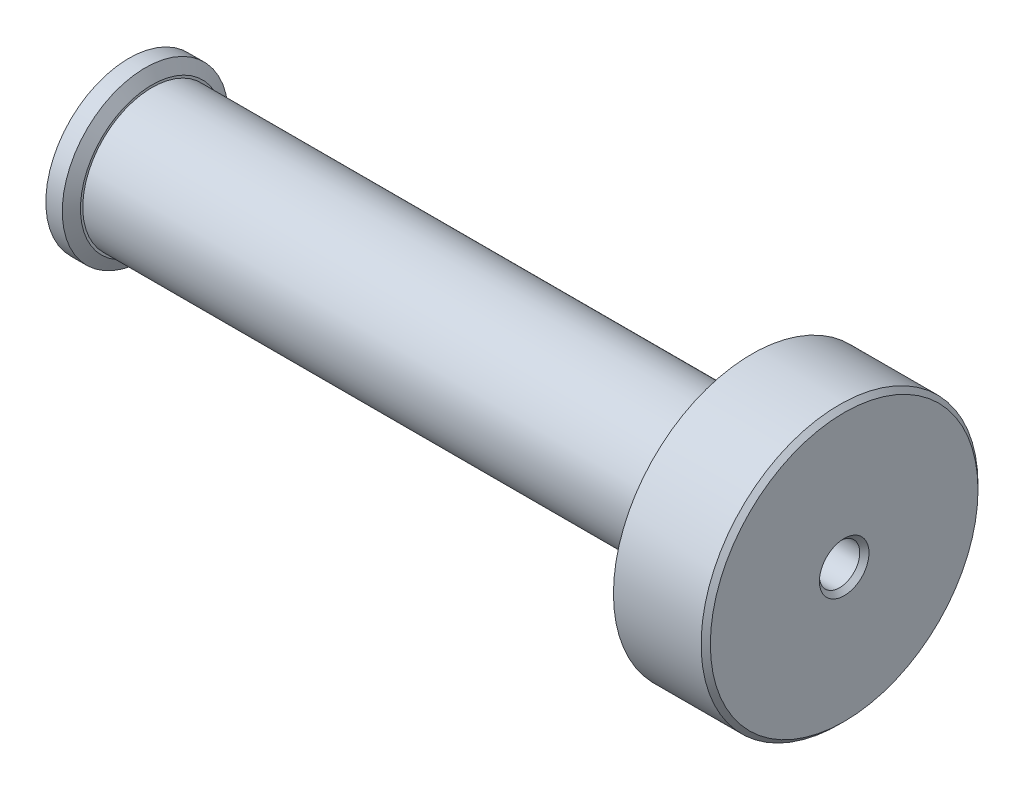
ISO-10303-21;
HEADER;
FILE_DESCRIPTION(('STEP AP214'),'2;1');
FILE_NAME('part.step','',(''),(''),'','','');
FILE_SCHEMA(('AUTOMOTIVE_DESIGN { 1 0 10303 214 1 1 1 1 }'));
ENDSEC;
DATA;
#1=APPLICATION_CONTEXT('core data for automotive mechanical design processes');
#2=APPLICATION_PROTOCOL_DEFINITION('international standard','automotive_design',2000,#1);
#3=PRODUCT_CONTEXT('',#1,'mechanical');
#4=PRODUCT('Part','Part','',(#3));
#5=PRODUCT_RELATED_PRODUCT_CATEGORY('part','',(#4));
#6=PRODUCT_DEFINITION_FORMATION('','',#4);
#7=PRODUCT_DEFINITION_CONTEXT('part definition',#1,'design');
#8=PRODUCT_DEFINITION('design','',#6,#7);
#9=PRODUCT_DEFINITION_SHAPE('','',#8);
#10=(LENGTH_UNIT() NAMED_UNIT(*) SI_UNIT(.MILLI.,.METRE.));
#11=(NAMED_UNIT(*) PLANE_ANGLE_UNIT() SI_UNIT($,.RADIAN.));
#12=(NAMED_UNIT(*) SI_UNIT($,.STERADIAN.) SOLID_ANGLE_UNIT());
#13=UNCERTAINTY_MEASURE_WITH_UNIT(LENGTH_MEASURE(1.E-05),#10,'distance_accuracy_value','');
#14=(GEOMETRIC_REPRESENTATION_CONTEXT(3) GLOBAL_UNCERTAINTY_ASSIGNED_CONTEXT((#13)) GLOBAL_UNIT_ASSIGNED_CONTEXT((#10,
#11,#12)) REPRESENTATION_CONTEXT('',''));
#15=CARTESIAN_POINT('',(0.,0.,0.));
#16=DIRECTION('',(0.,0.,1.));
#17=DIRECTION('',(1.,0.,0.));
#18=AXIS2_PLACEMENT_3D('',#15,#16,#17);
#19=CARTESIAN_POINT('',(-62.,0.,0.));
#20=DIRECTION('',(-1.,0.,0.));
#21=DIRECTION('',(0.,0.,1.));
#22=AXIS2_PLACEMENT_3D('',#19,#20,#21);
#23=PLANE('',#22);
#24=CARTESIAN_POINT('',(-62.,0.,0.));
#25=DIRECTION('',(-1.,0.,0.));
#26=DIRECTION('',(0.,0.,1.));
#27=AXIS2_PLACEMENT_3D('',#24,#25,#26);
#28=CIRCLE('',#27,4.8);
#29=CARTESIAN_POINT('',(-62.,0.,4.80000000000001));
#30=VERTEX_POINT('',#29);
#31=EDGE_CURVE('E83',#30,#30,#28,.T.);
#32=ORIENTED_EDGE('',*,*,#31,.F.);
#33=EDGE_LOOP('',(#32));
#34=FACE_BOUND('',#33,.T.);
#35=CARTESIAN_POINT('',(-62.,0.,0.));
#36=DIRECTION('',(1.,0.,0.));
#37=DIRECTION('',(0.,0.,-1.));
#38=AXIS2_PLACEMENT_3D('',#35,#36,#37);
#39=CIRCLE('',#38,7.2);
#40=CARTESIAN_POINT('',(-62.,0.,-7.19999999999999));
#41=VERTEX_POINT('',#40);
#42=EDGE_CURVE('E71',#41,#41,#39,.T.);
#43=ORIENTED_EDGE('',*,*,#42,.F.);
#44=EDGE_LOOP('',(#43));
#45=FACE_BOUND('',#44,.T.);
#46=ADVANCED_FACE('F36',(#34,#45),#23,.T.);
#47=CARTESIAN_POINT('',(0.,0.,0.));
#48=DIRECTION('',(1.,0.,0.));
#49=DIRECTION('',(0.,0.,-1.));
#50=AXIS2_PLACEMENT_3D('',#47,#48,#49);
#51=CYLINDRICAL_SURFACE('',#50,7.2);
#52=CARTESIAN_POINT('',(-60.5773502691896,0.,0.));
#53=DIRECTION('',(1.,0.,0.));
#54=DIRECTION('',(0.,0.,-1.));
#55=AXIS2_PLACEMENT_3D('',#52,#53,#54);
#56=CIRCLE('',#55,7.2);
#57=CARTESIAN_POINT('',(-60.5773502691896,0.,-7.19999999999999));
#58=VERTEX_POINT('',#57);
#59=EDGE_CURVE('E65',#58,#58,#56,.F.);
#60=ORIENTED_EDGE('',*,*,#59,.T.);
#61=EDGE_LOOP('',(#60));
#62=FACE_BOUND('',#61,.T.);
#63=ORIENTED_EDGE('',*,*,#42,.T.);
#64=EDGE_LOOP('',(#63));
#65=FACE_BOUND('',#64,.T.);
#66=ADVANCED_FACE('F109',(#62,#65),#51,.T.);
#67=CARTESIAN_POINT('',(-60.,0.,-7.19999999999999));
#68=DIRECTION('',(1.,0.,0.));
#69=DIRECTION('',(0.,0.,-1.));
#70=AXIS2_PLACEMENT_3D('',#67,#68,#69);
#71=PLANE('',#70);
#72=CARTESIAN_POINT('',(-60.,0.,0.));
#73=DIRECTION('',(1.,0.,0.));
#74=DIRECTION('',(0.,0.,-1.));
#75=AXIS2_PLACEMENT_3D('',#72,#73,#74);
#76=CIRCLE('',#75,6.19999999999998);
#77=CARTESIAN_POINT('',(-60.,0.,-6.19999999999997));
#78=VERTEX_POINT('',#77);
#79=EDGE_CURVE('E68',#78,#78,#76,.T.);
#80=ORIENTED_EDGE('',*,*,#79,.T.);
#81=EDGE_LOOP('',(#80));
#82=FACE_BOUND('',#81,.T.);
#83=CARTESIAN_POINT('',(-60.,0.,0.));
#84=DIRECTION('',(1.,0.,0.));
#85=DIRECTION('',(0.,0.,-1.));
#86=AXIS2_PLACEMENT_3D('',#83,#84,#85);
#87=CIRCLE('',#86,6.);
#88=CARTESIAN_POINT('',(-60.,0.,-5.99999999999999));
#89=VERTEX_POINT('',#88);
#90=EDGE_CURVE('E74',#89,#89,#87,.T.);
#91=ORIENTED_EDGE('',*,*,#90,.F.);
#92=EDGE_LOOP('',(#91));
#93=FACE_BOUND('',#92,.T.);
#94=ADVANCED_FACE('F115',(#82,#93),#71,.T.);
#95=CARTESIAN_POINT('',(0.,0.,0.));
#96=DIRECTION('',(1.,0.,0.));
#97=DIRECTION('',(0.,0.,-1.));
#98=AXIS2_PLACEMENT_3D('',#95,#96,#97);
#99=CYLINDRICAL_SURFACE('',#98,6.);
#100=ORIENTED_EDGE('',*,*,#90,.T.);
#101=EDGE_LOOP('',(#100));
#102=FACE_BOUND('',#101,.T.);
#103=CARTESIAN_POINT('',(-10.,0.,0.));
#104=DIRECTION('',(1.,0.,0.));
#105=DIRECTION('',(0.,0.,-1.));
#106=AXIS2_PLACEMENT_3D('',#103,#104,#105);
#107=CIRCLE('',#106,5.99999999999999);
#108=CARTESIAN_POINT('',(-10.,0.,-5.99999999999999));
#109=VERTEX_POINT('',#108);
#110=EDGE_CURVE('E77',#109,#109,#107,.T.);
#111=ORIENTED_EDGE('',*,*,#110,.F.);
#112=EDGE_LOOP('',(#111));
#113=FACE_BOUND('',#112,.T.);
#114=ADVANCED_FACE('F152',(#102,#113),#99,.T.);
#115=CARTESIAN_POINT('',(-10.,0.,-5.99999999999999));
#116=DIRECTION('',(-1.,0.,0.));
#117=DIRECTION('',(0.,0.,1.));
#118=AXIS2_PLACEMENT_3D('',#115,#116,#117);
#119=PLANE('',#118);
#120=CARTESIAN_POINT('',(-10.,0.,0.));
#121=DIRECTION('',(-1.,0.,0.));
#122=DIRECTION('',(0.,0.,1.));
#123=AXIS2_PLACEMENT_3D('',#120,#121,#122);
#124=CIRCLE('',#123,8.53589838486225);
#125=CARTESIAN_POINT('',(-10.,0.,8.53589838486225));
#126=VERTEX_POINT('',#125);
#127=EDGE_CURVE('E59',#126,#126,#124,.T.);
#128=ORIENTED_EDGE('',*,*,#127,.T.);
#129=EDGE_LOOP('',(#128));
#130=FACE_BOUND('',#129,.T.);
#131=ORIENTED_EDGE('',*,*,#110,.T.);
#132=EDGE_LOOP('',(#131));
#133=FACE_BOUND('',#132,.T.);
#134=ADVANCED_FACE('F147',(#130,#133),#119,.T.);
#135=CARTESIAN_POINT('',(0.,0.,0.));
#136=DIRECTION('',(1.,0.,0.));
#137=DIRECTION('',(0.,0.,-1.));
#138=AXIS2_PLACEMENT_3D('',#135,#136,#137);
#139=CYLINDRICAL_SURFACE('',#138,12.);
#140=CARTESIAN_POINT('',(-0.39999999999998,0.,0.));
#141=DIRECTION('',(1.,0.,0.));
#142=DIRECTION('',(0.,0.,-1.));
#143=AXIS2_PLACEMENT_3D('',#140,#141,#142);
#144=CIRCLE('',#143,12.);
#145=CARTESIAN_POINT('',(-0.399999999999981,0.,-12.));
#146=VERTEX_POINT('',#145);
#147=EDGE_CURVE('E43',#146,#146,#144,.F.);
#148=ORIENTED_EDGE('',*,*,#147,.T.);
#149=EDGE_LOOP('',(#148));
#150=FACE_BOUND('',#149,.T.);
#151=CARTESIAN_POINT('',(-8.,0.,0.));
#152=DIRECTION('',(-1.,0.,0.));
#153=DIRECTION('',(0.,0.,1.));
#154=AXIS2_PLACEMENT_3D('',#151,#152,#153);
#155=CIRCLE('',#154,12.);
#156=CARTESIAN_POINT('',(-7.99999999999999,0.,12.));
#157=VERTEX_POINT('',#156);
#158=EDGE_CURVE('E62',#157,#157,#155,.F.);
#159=ORIENTED_EDGE('',*,*,#158,.T.);
#160=EDGE_LOOP('',(#159));
#161=FACE_BOUND('',#160,.T.);
#162=ADVANCED_FACE('F140',(#150,#161),#139,.T.);
#163=CARTESIAN_POINT('',(0.,0.,-12.));
#164=DIRECTION('',(1.,0.,0.));
#165=DIRECTION('',(0.,0.,-1.));
#166=AXIS2_PLACEMENT_3D('',#163,#164,#165);
#167=PLANE('',#166);
#168=CARTESIAN_POINT('',(0.,0.,0.));
#169=DIRECTION('',(1.,0.,0.));
#170=DIRECTION('',(0.,0.,-1.));
#171=AXIS2_PLACEMENT_3D('',#168,#169,#170);
#172=CIRCLE('',#171,11.6);
#173=CARTESIAN_POINT('',(0.,0.,-11.6));
#174=VERTEX_POINT('',#173);
#175=EDGE_CURVE('E48',#174,#174,#172,.T.);
#176=ORIENTED_EDGE('',*,*,#175,.T.);
#177=EDGE_LOOP('',(#176));
#178=FACE_BOUND('',#177,.T.);
#179=CARTESIAN_POINT('',(0.,0.,0.));
#180=DIRECTION('',(1.,0.,0.));
#181=DIRECTION('',(0.,0.,-1.));
#182=AXIS2_PLACEMENT_3D('',#179,#180,#181);
#183=CIRCLE('',#182,2.15);
#184=CARTESIAN_POINT('',(0.,0.,-2.15));
#185=VERTEX_POINT('',#184);
#186=EDGE_CURVE('E54',#185,#185,#183,.F.);
#187=ORIENTED_EDGE('',*,*,#186,.T.);
#188=EDGE_LOOP('',(#187));
#189=FACE_BOUND('',#188,.T.);
#190=ADVANCED_FACE('F125',(#178,#189),#167,.T.);
#191=CARTESIAN_POINT('',(-60.,0.,0.));
#192=DIRECTION('',(-1.,0.,0.));
#193=DIRECTION('',(0.,0.,1.));
#194=AXIS2_PLACEMENT_3D('',#191,#192,#193);
#195=CONICAL_SURFACE('',#194,6.19999999999998,1.04719755119661);
#196=ORIENTED_EDGE('',*,*,#59,.F.);
#197=EDGE_LOOP('',(#196));
#198=FACE_BOUND('',#197,.T.);
#199=ORIENTED_EDGE('',*,*,#79,.F.);
#200=EDGE_LOOP('',(#199));
#201=FACE_BOUND('',#200,.T.);
#202=ADVANCED_FACE('F122',(#198,#201),#195,.T.);
#203=CARTESIAN_POINT('',(-8.,0.,0.));
#204=DIRECTION('',(1.,0.,0.));
#205=DIRECTION('',(0.,0.,-1.));
#206=AXIS2_PLACEMENT_3D('',#203,#204,#205);
#207=CONICAL_SURFACE('',#206,12.,1.0471975511966);
#208=ORIENTED_EDGE('',*,*,#127,.F.);
#209=EDGE_LOOP('',(#208));
#210=FACE_BOUND('',#209,.T.);
#211=ORIENTED_EDGE('',*,*,#158,.F.);
#212=EDGE_LOOP('',(#211));
#213=FACE_BOUND('',#212,.T.);
#214=ADVANCED_FACE('F96',(#210,#213),#207,.T.);
#215=CARTESIAN_POINT('',(-9.,0.,-12.));
#216=DIRECTION('',(1.,0.,0.));
#217=DIRECTION('',(0.,0.,-1.));
#218=AXIS2_PLACEMENT_3D('',#215,#216,#217);
#219=PLANE('',#218);
#220=CARTESIAN_POINT('',(-9.,0.,0.));
#221=DIRECTION('',(-1.,0.,0.));
#222=DIRECTION('',(0.,0.,1.));
#223=AXIS2_PLACEMENT_3D('',#220,#221,#222);
#224=CIRCLE('',#223,1.75);
#225=CARTESIAN_POINT('',(-9.,0.,1.75));
#226=VERTEX_POINT('',#225);
#227=EDGE_CURVE('E86',#226,#226,#224,.T.);
#228=ORIENTED_EDGE('',*,*,#227,.F.);
#229=EDGE_LOOP('',(#228));
#230=FACE_BOUND('',#229,.T.);
#231=CARTESIAN_POINT('',(-9.,0.,0.));
#232=DIRECTION('',(1.,0.,0.));
#233=DIRECTION('',(0.,0.,-1.));
#234=AXIS2_PLACEMENT_3D('',#231,#232,#233);
#235=CIRCLE('',#234,4.8);
#236=CARTESIAN_POINT('',(-9.,0.,-4.8));
#237=VERTEX_POINT('',#236);
#238=EDGE_CURVE('E80',#237,#237,#235,.F.);
#239=ORIENTED_EDGE('',*,*,#238,.T.);
#240=EDGE_LOOP('',(#239));
#241=FACE_BOUND('',#240,.T.);
#242=ADVANCED_FACE('F92',(#230,#241),#219,.F.);
#243=CARTESIAN_POINT('',(13.5764501987817,0.,0.));
#244=DIRECTION('',(-1.,0.,0.));
#245=DIRECTION('',(0.,0.,1.));
#246=AXIS2_PLACEMENT_3D('',#243,#244,#245);
#247=CYLINDRICAL_SURFACE('',#246,4.8);
#248=ORIENTED_EDGE('',*,*,#31,.T.);
#249=EDGE_LOOP('',(#248));
#250=FACE_BOUND('',#249,.T.);
#251=ORIENTED_EDGE('',*,*,#238,.F.);
#252=EDGE_LOOP('',(#251));
#253=FACE_BOUND('',#252,.T.);
#254=ADVANCED_FACE('F95',(#250,#253),#247,.F.);
#255=CARTESIAN_POINT('',(0.,0.,0.));
#256=DIRECTION('',(-1.,0.,0.));
#257=DIRECTION('',(0.,0.,1.));
#258=AXIS2_PLACEMENT_3D('',#255,#256,#257);
#259=CYLINDRICAL_SURFACE('',#258,1.75);
#260=CARTESIAN_POINT('',(-0.399999999999999,0.,0.));
#261=DIRECTION('',(1.,0.,0.));
#262=DIRECTION('',(0.,0.,-1.));
#263=AXIS2_PLACEMENT_3D('',#260,#261,#262);
#264=CIRCLE('',#263,1.75);
#265=CARTESIAN_POINT('',(-0.4,0.,-1.75));
#266=VERTEX_POINT('',#265);
#267=EDGE_CURVE('E11',#266,#266,#264,.T.);
#268=ORIENTED_EDGE('',*,*,#267,.T.);
#269=EDGE_LOOP('',(#268));
#270=FACE_BOUND('',#269,.T.);
#271=ORIENTED_EDGE('',*,*,#227,.T.);
#272=EDGE_LOOP('',(#271));
#273=FACE_BOUND('',#272,.T.);
#274=ADVANCED_FACE('F90',(#270,#273),#259,.F.);
#275=CARTESIAN_POINT('',(0.,0.,0.));
#276=DIRECTION('',(-1.,0.,0.));
#277=DIRECTION('',(0.,0.,1.));
#278=AXIS2_PLACEMENT_3D('',#275,#276,#277);
#279=CONICAL_SURFACE('',#278,11.6,0.785398163397444);
#280=ORIENTED_EDGE('',*,*,#147,.F.);
#281=EDGE_LOOP('',(#280));
#282=FACE_BOUND('',#281,.T.);
#283=ORIENTED_EDGE('',*,*,#175,.F.);
#284=EDGE_LOOP('',(#283));
#285=FACE_BOUND('',#284,.T.);
#286=ADVANCED_FACE('F106',(#282,#285),#279,.T.);
#287=CARTESIAN_POINT('',(0.,0.,0.));
#288=DIRECTION('',(1.,0.,0.));
#289=DIRECTION('',(0.,0.,-1.));
#290=AXIS2_PLACEMENT_3D('',#287,#288,#289);
#291=CONICAL_SURFACE('',#290,2.15,0.785398163397446);
#292=ORIENTED_EDGE('',*,*,#267,.F.);
#293=EDGE_LOOP('',(#292));
#294=FACE_BOUND('',#293,.T.);
#295=ORIENTED_EDGE('',*,*,#186,.F.);
#296=EDGE_LOOP('',(#295));
#297=FACE_BOUND('',#296,.T.);
#298=ADVANCED_FACE('F38',(#294,#297),#291,.F.);
#299=CLOSED_SHELL('',(#46,#66,#94,#114,#134,#162,#190,#202,#214,#242,#254,#274,#286,#298));
#300=MANIFOLD_SOLID_BREP('B2',#299);
#301=ADVANCED_BREP_SHAPE_REPRESENTATION('',(#18,#300),#14);
#302=SHAPE_DEFINITION_REPRESENTATION(#9,#301);
ENDSEC;
END-ISO-10303-21;
